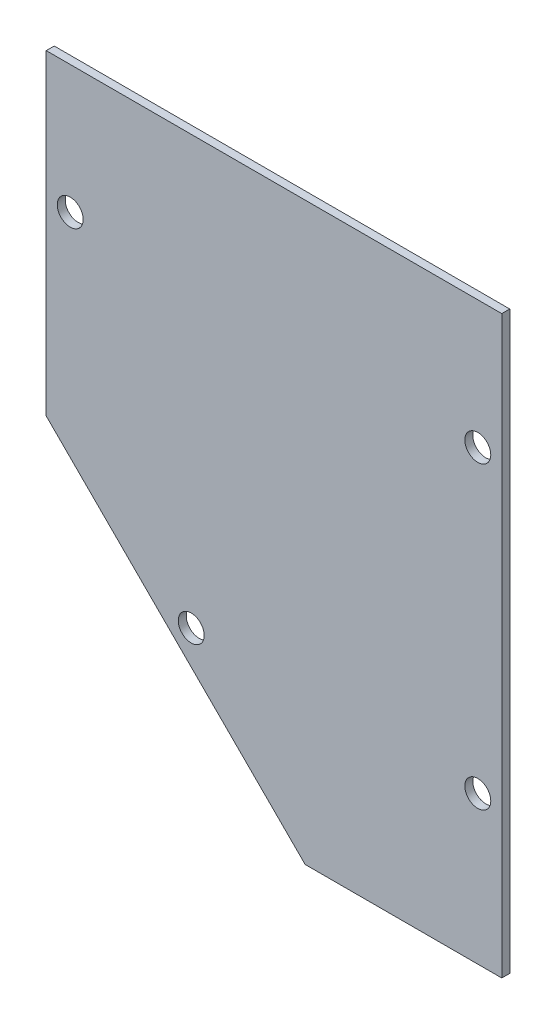
ISO-10303-21;
HEADER;
FILE_DESCRIPTION(('STEP AP214'),'2;1');
FILE_NAME('part.step','',(''),(''),'','','');
FILE_SCHEMA(('AUTOMOTIVE_DESIGN { 1 0 10303 214 1 1 1 1 }'));
ENDSEC;
DATA;
#1=APPLICATION_CONTEXT('core data for automotive mechanical design processes');
#2=APPLICATION_PROTOCOL_DEFINITION('international standard','automotive_design',2000,#1);
#3=PRODUCT_CONTEXT('',#1,'mechanical');
#4=PRODUCT('Part','Part','',(#3));
#5=PRODUCT_RELATED_PRODUCT_CATEGORY('part','',(#4));
#6=PRODUCT_DEFINITION_FORMATION('','',#4);
#7=PRODUCT_DEFINITION_CONTEXT('part definition',#1,'design');
#8=PRODUCT_DEFINITION('design','',#6,#7);
#9=PRODUCT_DEFINITION_SHAPE('','',#8);
#10=(LENGTH_UNIT() NAMED_UNIT(*) SI_UNIT(.MILLI.,.METRE.));
#11=(NAMED_UNIT(*) PLANE_ANGLE_UNIT() SI_UNIT($,.RADIAN.));
#12=(NAMED_UNIT(*) SI_UNIT($,.STERADIAN.) SOLID_ANGLE_UNIT());
#13=UNCERTAINTY_MEASURE_WITH_UNIT(LENGTH_MEASURE(1.E-05),#10,'distance_accuracy_value','');
#14=(GEOMETRIC_REPRESENTATION_CONTEXT(3) GLOBAL_UNCERTAINTY_ASSIGNED_CONTEXT((#13)) GLOBAL_UNIT_ASSIGNED_CONTEXT((#10,
#11,#12)) REPRESENTATION_CONTEXT('',''));
#15=CARTESIAN_POINT('',(0.,0.,0.));
#16=DIRECTION('',(0.,0.,1.));
#17=DIRECTION('',(1.,0.,0.));
#18=AXIS2_PLACEMENT_3D('',#15,#16,#17);
#19=CARTESIAN_POINT('',(-12.,-67.1999999999998,2.));
#20=DIRECTION('',(-0.707106781186549,-0.707106781186546,0.));
#21=DIRECTION('',(0.707106781186546,-0.707106781186549,0.));
#22=AXIS2_PLACEMENT_3D('',#19,#20,#21);
#23=PLANE('',#22);
#24=DIRECTION('',(0.,0.,1.));
#25=VECTOR('',#24,1.);
#26=CARTESIAN_POINT('',(-12.,-67.1999999999998,2.));
#27=LINE('',#26,#25);
#28=CARTESIAN_POINT('',(-12.,-67.1999999999998,0.));
#29=VERTEX_POINT('',#28);
#30=CARTESIAN_POINT('',(-12.,-67.1999999999998,2.));
#31=VERTEX_POINT('',#30);
#32=EDGE_CURVE('E11',#29,#31,#27,.T.);
#33=ORIENTED_EDGE('',*,*,#32,.F.);
#34=DIRECTION('',(0.707106781186546,-0.707106781186549,0.));
#35=VECTOR('',#34,1.);
#36=CARTESIAN_POINT('',(-12.,-67.1999999999998,0.));
#37=LINE('',#36,#35);
#38=CARTESIAN_POINT('',(52.8,-132.,0.));
#39=VERTEX_POINT('',#38);
#40=EDGE_CURVE('E94',#29,#39,#37,.T.);
#41=ORIENTED_EDGE('',*,*,#40,.T.);
#42=DIRECTION('',(0.,0.,1.));
#43=VECTOR('',#42,1.);
#44=CARTESIAN_POINT('',(52.8,-132.,2.));
#45=LINE('',#44,#43);
#46=CARTESIAN_POINT('',(52.8,-132.,2.));
#47=VERTEX_POINT('',#46);
#48=EDGE_CURVE('E46',#39,#47,#45,.T.);
#49=ORIENTED_EDGE('',*,*,#48,.T.);
#50=DIRECTION('',(0.707106781186546,-0.707106781186549,0.));
#51=VECTOR('',#50,1.);
#52=CARTESIAN_POINT('',(-12.,-67.1999999999998,2.));
#53=LINE('',#52,#51);
#54=EDGE_CURVE('E117',#31,#47,#53,.T.);
#55=ORIENTED_EDGE('',*,*,#54,.F.);
#56=EDGE_LOOP('',(#33,#41,#49,#55));
#57=FACE_BOUND('',#56,.T.);
#58=ADVANCED_FACE('F36',(#57),#23,.T.);
#59=CARTESIAN_POINT('',(52.8,-132.,2.));
#60=DIRECTION('',(0.,-1.,0.));
#61=DIRECTION('',(1.,0.,0.));
#62=AXIS2_PLACEMENT_3D('',#59,#60,#61);
#63=PLANE('',#62);
#64=ORIENTED_EDGE('',*,*,#48,.F.);
#65=DIRECTION('',(1.,0.,0.));
#66=VECTOR('',#65,1.);
#67=CARTESIAN_POINT('',(0.,-132.,0.));
#68=LINE('',#67,#66);
#69=CARTESIAN_POINT('',(102.,-132.,0.));
#70=VERTEX_POINT('',#69);
#71=EDGE_CURVE('E107',#39,#70,#68,.T.);
#72=ORIENTED_EDGE('',*,*,#71,.T.);
#73=DIRECTION('',(0.,0.,1.));
#74=VECTOR('',#73,1.);
#75=CARTESIAN_POINT('',(102.,-132.,2.));
#76=LINE('',#75,#74);
#77=CARTESIAN_POINT('',(102.,-132.,2.));
#78=VERTEX_POINT('',#77);
#79=EDGE_CURVE('E112',#70,#78,#76,.T.);
#80=ORIENTED_EDGE('',*,*,#79,.T.);
#81=DIRECTION('',(1.,0.,0.));
#82=VECTOR('',#81,1.);
#83=CARTESIAN_POINT('',(52.8,-132.,2.));
#84=LINE('',#83,#82);
#85=EDGE_CURVE('E124',#47,#78,#84,.T.);
#86=ORIENTED_EDGE('',*,*,#85,.F.);
#87=EDGE_LOOP('',(#64,#72,#80,#86));
#88=FACE_BOUND('',#87,.T.);
#89=ADVANCED_FACE('F126',(#88),#63,.T.);
#90=CARTESIAN_POINT('',(102.,-132.,2.));
#91=DIRECTION('',(1.,0.,0.));
#92=DIRECTION('',(0.,1.,0.));
#93=AXIS2_PLACEMENT_3D('',#90,#91,#92);
#94=PLANE('',#93);
#95=ORIENTED_EDGE('',*,*,#79,.F.);
#96=DIRECTION('',(0.,1.,0.));
#97=VECTOR('',#96,1.);
#98=CARTESIAN_POINT('',(102.,0.,0.));
#99=LINE('',#98,#97);
#100=CARTESIAN_POINT('',(102.,12.,0.));
#101=VERTEX_POINT('',#100);
#102=EDGE_CURVE('E104',#70,#101,#99,.T.);
#103=ORIENTED_EDGE('',*,*,#102,.T.);
#104=DIRECTION('',(0.,0.,1.));
#105=VECTOR('',#104,1.);
#106=CARTESIAN_POINT('',(102.,12.,2.));
#107=LINE('',#106,#105);
#108=CARTESIAN_POINT('',(102.,12.,2.));
#109=VERTEX_POINT('',#108);
#110=EDGE_CURVE('E54',#101,#109,#107,.T.);
#111=ORIENTED_EDGE('',*,*,#110,.T.);
#112=DIRECTION('',(0.,1.,0.));
#113=VECTOR('',#112,1.);
#114=CARTESIAN_POINT('',(102.,-132.,2.));
#115=LINE('',#114,#113);
#116=EDGE_CURVE('E87',#78,#109,#115,.T.);
#117=ORIENTED_EDGE('',*,*,#116,.F.);
#118=EDGE_LOOP('',(#95,#103,#111,#117));
#119=FACE_BOUND('',#118,.T.);
#120=ADVANCED_FACE('F161',(#119),#94,.T.);
#121=CARTESIAN_POINT('',(102.,12.,2.));
#122=DIRECTION('',(0.,1.,0.));
#123=DIRECTION('',(-1.,0.,0.));
#124=AXIS2_PLACEMENT_3D('',#121,#122,#123);
#125=PLANE('',#124);
#126=ORIENTED_EDGE('',*,*,#110,.F.);
#127=DIRECTION('',(1.,0.,0.));
#128=VECTOR('',#127,1.);
#129=CARTESIAN_POINT('',(0.,12.,0.));
#130=LINE('',#129,#128);
#131=CARTESIAN_POINT('',(-12.,12.,0.));
#132=VERTEX_POINT('',#131);
#133=EDGE_CURVE('E92',#101,#132,#130,.F.);
#134=ORIENTED_EDGE('',*,*,#133,.T.);
#135=DIRECTION('',(0.,0.,1.));
#136=VECTOR('',#135,1.);
#137=CARTESIAN_POINT('',(-12.,12.,2.));
#138=LINE('',#137,#136);
#139=CARTESIAN_POINT('',(-12.,12.,2.));
#140=VERTEX_POINT('',#139);
#141=EDGE_CURVE('E40',#132,#140,#138,.T.);
#142=ORIENTED_EDGE('',*,*,#141,.T.);
#143=DIRECTION('',(-1.,0.,0.));
#144=VECTOR('',#143,1.);
#145=CARTESIAN_POINT('',(102.,12.,2.));
#146=LINE('',#145,#144);
#147=EDGE_CURVE('E197',#109,#140,#146,.T.);
#148=ORIENTED_EDGE('',*,*,#147,.F.);
#149=EDGE_LOOP('',(#126,#134,#142,#148));
#150=FACE_BOUND('',#149,.T.);
#151=ADVANCED_FACE('F96',(#150),#125,.T.);
#152=CARTESIAN_POINT('',(96.,-95.,2.));
#153=DIRECTION('',(0.,0.,1.));
#154=DIRECTION('',(1.,0.,0.));
#155=AXIS2_PLACEMENT_3D('',#152,#153,#154);
#156=CYLINDRICAL_SURFACE('',#155,3.25000000000001);
#157=CARTESIAN_POINT('',(96.,-95.,2.));
#158=DIRECTION('',(0.,0.,1.));
#159=DIRECTION('',(1.,0.,0.));
#160=AXIS2_PLACEMENT_3D('',#157,#158,#159);
#161=CIRCLE('',#160,3.25000000000001);
#162=CARTESIAN_POINT('',(99.25,-95.,2.));
#163=VERTEX_POINT('',#162);
#164=EDGE_CURVE('E106',#163,#163,#161,.T.);
#165=ORIENTED_EDGE('',*,*,#164,.T.);
#166=EDGE_LOOP('',(#165));
#167=FACE_BOUND('',#166,.T.);
#168=CARTESIAN_POINT('',(96.,-95.,0.));
#169=DIRECTION('',(0.,0.,1.));
#170=DIRECTION('',(1.,0.,0.));
#171=AXIS2_PLACEMENT_3D('',#168,#169,#170);
#172=CIRCLE('',#171,3.25000000000001);
#173=CARTESIAN_POINT('',(99.25,-95.,0.));
#174=VERTEX_POINT('',#173);
#175=EDGE_CURVE('E131',#174,#174,#172,.T.);
#176=ORIENTED_EDGE('',*,*,#175,.F.);
#177=EDGE_LOOP('',(#176));
#178=FACE_BOUND('',#177,.T.);
#179=ADVANCED_FACE('F153',(#167,#178),#156,.F.);
#180=CARTESIAN_POINT('',(-6.,-20.,2.));
#181=DIRECTION('',(0.,0.,1.));
#182=DIRECTION('',(1.,0.,0.));
#183=AXIS2_PLACEMENT_3D('',#180,#181,#182);
#184=CYLINDRICAL_SURFACE('',#183,3.25);
#185=CARTESIAN_POINT('',(-6.,-20.,2.));
#186=DIRECTION('',(0.,0.,1.));
#187=DIRECTION('',(1.,0.,0.));
#188=AXIS2_PLACEMENT_3D('',#185,#186,#187);
#189=CIRCLE('',#188,3.25);
#190=CARTESIAN_POINT('',(-2.75,-20.,2.));
#191=VERTEX_POINT('',#190);
#192=EDGE_CURVE('E190',#191,#191,#189,.T.);
#193=ORIENTED_EDGE('',*,*,#192,.T.);
#194=EDGE_LOOP('',(#193));
#195=FACE_BOUND('',#194,.T.);
#196=CARTESIAN_POINT('',(-6.,-20.,0.));
#197=DIRECTION('',(0.,0.,1.));
#198=DIRECTION('',(1.,0.,0.));
#199=AXIS2_PLACEMENT_3D('',#196,#197,#198);
#200=CIRCLE('',#199,3.25);
#201=CARTESIAN_POINT('',(-2.75,-20.,0.));
#202=VERTEX_POINT('',#201);
#203=EDGE_CURVE('E134',#202,#202,#200,.T.);
#204=ORIENTED_EDGE('',*,*,#203,.F.);
#205=EDGE_LOOP('',(#204));
#206=FACE_BOUND('',#205,.T.);
#207=ADVANCED_FACE('F144',(#195,#206),#184,.F.);
#208=CARTESIAN_POINT('',(96.,-20.,2.));
#209=DIRECTION('',(0.,0.,1.));
#210=DIRECTION('',(1.,0.,0.));
#211=AXIS2_PLACEMENT_3D('',#208,#209,#210);
#212=CYLINDRICAL_SURFACE('',#211,3.25000000000001);
#213=CARTESIAN_POINT('',(96.,-20.,2.));
#214=DIRECTION('',(0.,0.,1.));
#215=DIRECTION('',(1.,0.,0.));
#216=AXIS2_PLACEMENT_3D('',#213,#214,#215);
#217=CIRCLE('',#216,3.25000000000001);
#218=CARTESIAN_POINT('',(99.25,-20.,2.));
#219=VERTEX_POINT('',#218);
#220=EDGE_CURVE('E193',#219,#219,#217,.T.);
#221=ORIENTED_EDGE('',*,*,#220,.T.);
#222=EDGE_LOOP('',(#221));
#223=FACE_BOUND('',#222,.T.);
#224=CARTESIAN_POINT('',(96.,-20.,0.));
#225=DIRECTION('',(0.,0.,1.));
#226=DIRECTION('',(1.,0.,0.));
#227=AXIS2_PLACEMENT_3D('',#224,#225,#226);
#228=CIRCLE('',#227,3.25000000000001);
#229=CARTESIAN_POINT('',(99.25,-20.,0.));
#230=VERTEX_POINT('',#229);
#231=EDGE_CURVE('E100',#230,#230,#228,.T.);
#232=ORIENTED_EDGE('',*,*,#231,.F.);
#233=EDGE_LOOP('',(#232));
#234=FACE_BOUND('',#233,.T.);
#235=ADVANCED_FACE('F141',(#223,#234),#212,.F.);
#236=CARTESIAN_POINT('',(24.2852813742386,-95.,2.));
#237=DIRECTION('',(0.,0.,1.));
#238=DIRECTION('',(1.,0.,0.));
#239=AXIS2_PLACEMENT_3D('',#236,#237,#238);
#240=CYLINDRICAL_SURFACE('',#239,3.25);
#241=CARTESIAN_POINT('',(24.2852813742386,-95.,2.));
#242=DIRECTION('',(0.,0.,1.));
#243=DIRECTION('',(1.,0.,0.));
#244=AXIS2_PLACEMENT_3D('',#241,#242,#243);
#245=CIRCLE('',#244,3.25);
#246=CARTESIAN_POINT('',(27.5352813742386,-95.,2.));
#247=VERTEX_POINT('',#246);
#248=EDGE_CURVE('E196',#247,#247,#245,.T.);
#249=ORIENTED_EDGE('',*,*,#248,.T.);
#250=EDGE_LOOP('',(#249));
#251=FACE_BOUND('',#250,.T.);
#252=CARTESIAN_POINT('',(24.2852813742386,-95.,0.));
#253=DIRECTION('',(0.,0.,1.));
#254=DIRECTION('',(1.,0.,0.));
#255=AXIS2_PLACEMENT_3D('',#252,#253,#254);
#256=CIRCLE('',#255,3.25);
#257=CARTESIAN_POINT('',(27.5352813742386,-95.,0.));
#258=VERTEX_POINT('',#257);
#259=EDGE_CURVE('E97',#258,#258,#256,.T.);
#260=ORIENTED_EDGE('',*,*,#259,.F.);
#261=EDGE_LOOP('',(#260));
#262=FACE_BOUND('',#261,.T.);
#263=ADVANCED_FACE('F143',(#251,#262),#240,.F.);
#264=CARTESIAN_POINT('',(-12.,12.,2.));
#265=DIRECTION('',(-1.,0.,0.));
#266=DIRECTION('',(0.,-1.,0.));
#267=AXIS2_PLACEMENT_3D('',#264,#265,#266);
#268=PLANE('',#267);
#269=DIRECTION('',(0.,1.,0.));
#270=VECTOR('',#269,1.);
#271=CARTESIAN_POINT('',(-12.,0.,0.));
#272=LINE('',#271,#270);
#273=EDGE_CURVE('E81',#132,#29,#272,.F.);
#274=ORIENTED_EDGE('',*,*,#273,.T.);
#275=ORIENTED_EDGE('',*,*,#32,.T.);
#276=DIRECTION('',(0.,-1.,0.));
#277=VECTOR('',#276,1.);
#278=CARTESIAN_POINT('',(-12.,12.,2.));
#279=LINE('',#278,#277);
#280=EDGE_CURVE('E83',#140,#31,#279,.T.);
#281=ORIENTED_EDGE('',*,*,#280,.F.);
#282=ORIENTED_EDGE('',*,*,#141,.F.);
#283=EDGE_LOOP('',(#274,#275,#281,#282));
#284=FACE_BOUND('',#283,.T.);
#285=ADVANCED_FACE('F38',(#284),#268,.T.);
#286=CARTESIAN_POINT('',(0.,0.,2.));
#287=DIRECTION('',(0.,0.,1.));
#288=DIRECTION('',(1.,0.,0.));
#289=AXIS2_PLACEMENT_3D('',#286,#287,#288);
#290=PLANE('',#289);
#291=ORIENTED_EDGE('',*,*,#164,.F.);
#292=EDGE_LOOP('',(#291));
#293=FACE_BOUND('',#292,.T.);
#294=ORIENTED_EDGE('',*,*,#192,.F.);
#295=EDGE_LOOP('',(#294));
#296=FACE_BOUND('',#295,.T.);
#297=ORIENTED_EDGE('',*,*,#220,.F.);
#298=EDGE_LOOP('',(#297));
#299=FACE_BOUND('',#298,.T.);
#300=ORIENTED_EDGE('',*,*,#248,.F.);
#301=EDGE_LOOP('',(#300));
#302=FACE_BOUND('',#301,.T.);
#303=ORIENTED_EDGE('',*,*,#147,.T.);
#304=ORIENTED_EDGE('',*,*,#280,.T.);
#305=ORIENTED_EDGE('',*,*,#54,.T.);
#306=ORIENTED_EDGE('',*,*,#85,.T.);
#307=ORIENTED_EDGE('',*,*,#116,.T.);
#308=EDGE_LOOP('',(#303,#304,#305,#306,#307));
#309=FACE_BOUND('',#308,.T.);
#310=ADVANCED_FACE('F122',(#293,#296,#299,#302,#309),#290,.T.);
#311=CARTESIAN_POINT('',(0.,0.,0.));
#312=DIRECTION('',(0.,0.,1.));
#313=DIRECTION('',(1.,0.,0.));
#314=AXIS2_PLACEMENT_3D('',#311,#312,#313);
#315=PLANE('',#314);
#316=ORIENTED_EDGE('',*,*,#175,.T.);
#317=EDGE_LOOP('',(#316));
#318=FACE_BOUND('',#317,.T.);
#319=ORIENTED_EDGE('',*,*,#203,.T.);
#320=EDGE_LOOP('',(#319));
#321=FACE_BOUND('',#320,.T.);
#322=ORIENTED_EDGE('',*,*,#231,.T.);
#323=EDGE_LOOP('',(#322));
#324=FACE_BOUND('',#323,.T.);
#325=ORIENTED_EDGE('',*,*,#259,.T.);
#326=EDGE_LOOP('',(#325));
#327=FACE_BOUND('',#326,.T.);
#328=ORIENTED_EDGE('',*,*,#133,.F.);
#329=ORIENTED_EDGE('',*,*,#102,.F.);
#330=ORIENTED_EDGE('',*,*,#71,.F.);
#331=ORIENTED_EDGE('',*,*,#40,.F.);
#332=ORIENTED_EDGE('',*,*,#273,.F.);
#333=EDGE_LOOP('',(#328,#329,#330,#331,#332));
#334=FACE_BOUND('',#333,.T.);
#335=ADVANCED_FACE('F90',(#318,#321,#324,#327,#334),#315,.F.);
#336=CLOSED_SHELL('',(#58,#89,#120,#151,#179,#207,#235,#263,#285,#310,#335));
#337=MANIFOLD_SOLID_BREP('B2',#336);
#338=ADVANCED_BREP_SHAPE_REPRESENTATION('',(#18,#337),#14);
#339=SHAPE_DEFINITION_REPRESENTATION(#9,#338);
ENDSEC;
END-ISO-10303-21;
